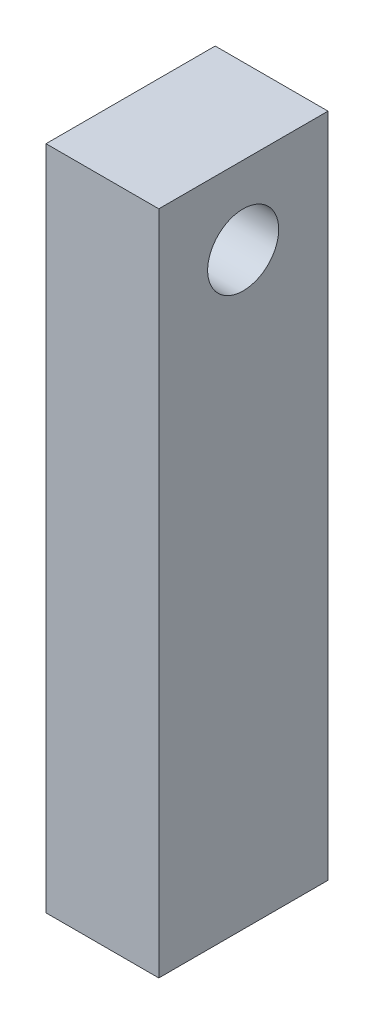
ISO-10303-21;
HEADER;
FILE_DESCRIPTION(('STEP AP214'),'2;1');
FILE_NAME('part.step','',(''),(''),'','','');
FILE_SCHEMA(('AUTOMOTIVE_DESIGN { 1 0 10303 214 1 1 1 1 }'));
ENDSEC;
DATA;
#1=APPLICATION_CONTEXT('core data for automotive mechanical design processes');
#2=APPLICATION_PROTOCOL_DEFINITION('international standard','automotive_design',2000,#1);
#3=PRODUCT_CONTEXT('',#1,'mechanical');
#4=PRODUCT('Part','Part','',(#3));
#5=PRODUCT_RELATED_PRODUCT_CATEGORY('part','',(#4));
#6=PRODUCT_DEFINITION_FORMATION('','',#4);
#7=PRODUCT_DEFINITION_CONTEXT('part definition',#1,'design');
#8=PRODUCT_DEFINITION('design','',#6,#7);
#9=PRODUCT_DEFINITION_SHAPE('','',#8);
#10=(LENGTH_UNIT() NAMED_UNIT(*) SI_UNIT(.MILLI.,.METRE.));
#11=(NAMED_UNIT(*) PLANE_ANGLE_UNIT() SI_UNIT($,.RADIAN.));
#12=(NAMED_UNIT(*) SI_UNIT($,.STERADIAN.) SOLID_ANGLE_UNIT());
#13=UNCERTAINTY_MEASURE_WITH_UNIT(LENGTH_MEASURE(1.E-05),#10,'distance_accuracy_value','');
#14=(GEOMETRIC_REPRESENTATION_CONTEXT(3) GLOBAL_UNCERTAINTY_ASSIGNED_CONTEXT((#13)) GLOBAL_UNIT_ASSIGNED_CONTEXT((#10,
#11,#12)) REPRESENTATION_CONTEXT('',''));
#15=CARTESIAN_POINT('',(0.,0.,0.));
#16=DIRECTION('',(0.,0.,1.));
#17=DIRECTION('',(1.,0.,0.));
#18=AXIS2_PLACEMENT_3D('',#15,#16,#17);
#19=CARTESIAN_POINT('',(0.,300.,0.));
#20=DIRECTION('',(1.,0.,0.));
#21=DIRECTION('',(0.,0.,-1.));
#22=AXIS2_PLACEMENT_3D('',#19,#20,#21);
#23=PLANE('',#22);
#24=CARTESIAN_POINT('',(0.,265.,-38.));
#25=DIRECTION('',(1.,0.,0.));
#26=DIRECTION('',(0.,0.,-1.));
#27=AXIS2_PLACEMENT_3D('',#24,#25,#26);
#28=CIRCLE('',#27,16.);
#29=CARTESIAN_POINT('',(0.,265.,-54.));
#30=VERTEX_POINT('',#29);
#31=EDGE_CURVE('E111',#30,#30,#28,.T.);
#32=ORIENTED_EDGE('',*,*,#31,.T.);
#33=EDGE_LOOP('',(#32));
#34=FACE_BOUND('',#33,.T.);
#35=DIRECTION('',(0.,0.,1.));
#36=VECTOR('',#35,1.);
#37=CARTESIAN_POINT('',(0.,0.,0.));
#38=LINE('',#37,#36);
#39=CARTESIAN_POINT('',(0.,0.,-76.2));
#40=VERTEX_POINT('',#39);
#41=CARTESIAN_POINT('',(0.,0.,0.));
#42=VERTEX_POINT('',#41);
#43=EDGE_CURVE('E108',#40,#42,#38,.T.);
#44=ORIENTED_EDGE('',*,*,#43,.T.);
#45=DIRECTION('',(0.,-1.,0.));
#46=VECTOR('',#45,1.);
#47=CARTESIAN_POINT('',(0.,300.,0.));
#48=LINE('',#47,#46);
#49=CARTESIAN_POINT('',(0.,300.,0.));
#50=VERTEX_POINT('',#49);
#51=EDGE_CURVE('E13',#50,#42,#48,.T.);
#52=ORIENTED_EDGE('',*,*,#51,.F.);
#53=DIRECTION('',(0.,0.,1.));
#54=VECTOR('',#53,1.);
#55=CARTESIAN_POINT('',(0.,300.,0.));
#56=LINE('',#55,#54);
#57=CARTESIAN_POINT('',(0.,300.,-76.2));
#58=VERTEX_POINT('',#57);
#59=EDGE_CURVE('E96',#58,#50,#56,.T.);
#60=ORIENTED_EDGE('',*,*,#59,.F.);
#61=DIRECTION('',(0.,-1.,0.));
#62=VECTOR('',#61,1.);
#63=CARTESIAN_POINT('',(0.,300.,-76.2));
#64=LINE('',#63,#62);
#65=EDGE_CURVE('E104',#58,#40,#64,.T.);
#66=ORIENTED_EDGE('',*,*,#65,.T.);
#67=EDGE_LOOP('',(#44,#52,#60,#66));
#68=FACE_BOUND('',#67,.T.);
#69=ADVANCED_FACE('F45',(#34,#68),#23,.F.);
#70=CARTESIAN_POINT('',(0.,300.,0.));
#71=DIRECTION('',(0.,0.,-1.));
#72=DIRECTION('',(-1.,0.,0.));
#73=AXIS2_PLACEMENT_3D('',#70,#71,#72);
#74=PLANE('',#73);
#75=DIRECTION('',(1.,0.,0.));
#76=VECTOR('',#75,1.);
#77=CARTESIAN_POINT('',(0.,0.,0.));
#78=LINE('',#77,#76);
#79=CARTESIAN_POINT('',(50.8,0.,0.));
#80=VERTEX_POINT('',#79);
#81=EDGE_CURVE('E100',#42,#80,#78,.T.);
#82=ORIENTED_EDGE('',*,*,#81,.T.);
#83=DIRECTION('',(0.,-1.,0.));
#84=VECTOR('',#83,1.);
#85=CARTESIAN_POINT('',(50.8,300.,0.));
#86=LINE('',#85,#84);
#87=CARTESIAN_POINT('',(50.8,300.,0.));
#88=VERTEX_POINT('',#87);
#89=EDGE_CURVE('E53',#88,#80,#86,.T.);
#90=ORIENTED_EDGE('',*,*,#89,.F.);
#91=DIRECTION('',(1.,0.,0.));
#92=VECTOR('',#91,1.);
#93=CARTESIAN_POINT('',(0.,300.,0.));
#94=LINE('',#93,#92);
#95=EDGE_CURVE('E91',#50,#88,#94,.T.);
#96=ORIENTED_EDGE('',*,*,#95,.F.);
#97=ORIENTED_EDGE('',*,*,#51,.T.);
#98=EDGE_LOOP('',(#82,#90,#96,#97));
#99=FACE_BOUND('',#98,.T.);
#100=ADVANCED_FACE('F99',(#99),#74,.F.);
#101=CARTESIAN_POINT('',(50.8,300.,0.));
#102=DIRECTION('',(-1.,0.,0.));
#103=DIRECTION('',(0.,0.,1.));
#104=AXIS2_PLACEMENT_3D('',#101,#102,#103);
#105=PLANE('',#104);
#106=CARTESIAN_POINT('',(50.8,265.,-38.));
#107=DIRECTION('',(1.,0.,0.));
#108=DIRECTION('',(0.,0.,-1.));
#109=AXIS2_PLACEMENT_3D('',#106,#107,#108);
#110=CIRCLE('',#109,16.);
#111=CARTESIAN_POINT('',(50.8,265.,-54.));
#112=VERTEX_POINT('',#111);
#113=EDGE_CURVE('E124',#112,#112,#110,.T.);
#114=ORIENTED_EDGE('',*,*,#113,.F.);
#115=EDGE_LOOP('',(#114));
#116=FACE_BOUND('',#115,.T.);
#117=DIRECTION('',(0.,0.,-1.));
#118=VECTOR('',#117,1.);
#119=CARTESIAN_POINT('',(50.8,0.,0.));
#120=LINE('',#119,#118);
#121=CARTESIAN_POINT('',(50.8,0.,-76.2));
#122=VERTEX_POINT('',#121);
#123=EDGE_CURVE('E78',#80,#122,#120,.T.);
#124=ORIENTED_EDGE('',*,*,#123,.T.);
#125=DIRECTION('',(0.,-1.,0.));
#126=VECTOR('',#125,1.);
#127=CARTESIAN_POINT('',(50.8,300.,-76.2));
#128=LINE('',#127,#126);
#129=CARTESIAN_POINT('',(50.8,300.,-76.2));
#130=VERTEX_POINT('',#129);
#131=EDGE_CURVE('E101',#130,#122,#128,.T.);
#132=ORIENTED_EDGE('',*,*,#131,.F.);
#133=DIRECTION('',(0.,0.,-1.));
#134=VECTOR('',#133,1.);
#135=CARTESIAN_POINT('',(50.8,300.,0.));
#136=LINE('',#135,#134);
#137=EDGE_CURVE('E94',#88,#130,#136,.T.);
#138=ORIENTED_EDGE('',*,*,#137,.F.);
#139=ORIENTED_EDGE('',*,*,#89,.T.);
#140=EDGE_LOOP('',(#124,#132,#138,#139));
#141=FACE_BOUND('',#140,.T.);
#142=ADVANCED_FACE('F102',(#116,#141),#105,.F.);
#143=CARTESIAN_POINT('',(0.,300.,-76.2));
#144=DIRECTION('',(0.,0.,1.));
#145=DIRECTION('',(1.,0.,0.));
#146=AXIS2_PLACEMENT_3D('',#143,#144,#145);
#147=PLANE('',#146);
#148=DIRECTION('',(-1.,0.,0.));
#149=VECTOR('',#148,1.);
#150=CARTESIAN_POINT('',(0.,0.,-76.2));
#151=LINE('',#150,#149);
#152=EDGE_CURVE('E84',#122,#40,#151,.T.);
#153=ORIENTED_EDGE('',*,*,#152,.T.);
#154=ORIENTED_EDGE('',*,*,#65,.F.);
#155=DIRECTION('',(-1.,0.,0.));
#156=VECTOR('',#155,1.);
#157=CARTESIAN_POINT('',(0.,300.,-76.2));
#158=LINE('',#157,#156);
#159=EDGE_CURVE('E61',#130,#58,#158,.T.);
#160=ORIENTED_EDGE('',*,*,#159,.F.);
#161=ORIENTED_EDGE('',*,*,#131,.T.);
#162=EDGE_LOOP('',(#153,#154,#160,#161));
#163=FACE_BOUND('',#162,.T.);
#164=ADVANCED_FACE('F116',(#163),#147,.F.);
#165=CARTESIAN_POINT('',(0.,300.,-76.2));
#166=DIRECTION('',(0.,-1.,0.));
#167=DIRECTION('',(0.,0.,-1.));
#168=AXIS2_PLACEMENT_3D('',#165,#166,#167);
#169=PLANE('',#168);
#170=ORIENTED_EDGE('',*,*,#59,.T.);
#171=ORIENTED_EDGE('',*,*,#95,.T.);
#172=ORIENTED_EDGE('',*,*,#137,.T.);
#173=ORIENTED_EDGE('',*,*,#159,.T.);
#174=EDGE_LOOP('',(#170,#171,#172,#173));
#175=FACE_BOUND('',#174,.T.);
#176=ADVANCED_FACE('F92',(#175),#169,.F.);
#177=CARTESIAN_POINT('',(0.,0.,-76.2));
#178=DIRECTION('',(0.,-1.,0.));
#179=DIRECTION('',(0.,0.,-1.));
#180=AXIS2_PLACEMENT_3D('',#177,#178,#179);
#181=PLANE('',#180);
#182=ORIENTED_EDGE('',*,*,#43,.F.);
#183=ORIENTED_EDGE('',*,*,#152,.F.);
#184=ORIENTED_EDGE('',*,*,#123,.F.);
#185=ORIENTED_EDGE('',*,*,#81,.F.);
#186=EDGE_LOOP('',(#182,#183,#184,#185));
#187=FACE_BOUND('',#186,.T.);
#188=ADVANCED_FACE('F119',(#187),#181,.T.);
#189=CARTESIAN_POINT('',(-99.2,265.,-38.));
#190=DIRECTION('',(1.,0.,0.));
#191=DIRECTION('',(0.,0.,-1.));
#192=AXIS2_PLACEMENT_3D('',#189,#190,#191);
#193=CYLINDRICAL_SURFACE('',#192,16.);
#194=ORIENTED_EDGE('',*,*,#113,.T.);
#195=EDGE_LOOP('',(#194));
#196=FACE_BOUND('',#195,.T.);
#197=ORIENTED_EDGE('',*,*,#31,.F.);
#198=EDGE_LOOP('',(#197));
#199=FACE_BOUND('',#198,.T.);
#200=ADVANCED_FACE('F128',(#196,#199),#193,.F.);
#201=CLOSED_SHELL('',(#69,#100,#142,#164,#176,#188,#200));
#202=MANIFOLD_SOLID_BREP('B2',#201);
#203=ADVANCED_BREP_SHAPE_REPRESENTATION('',(#18,#202),#14);
#204=SHAPE_DEFINITION_REPRESENTATION(#9,#203);
ENDSEC;
END-ISO-10303-21;
